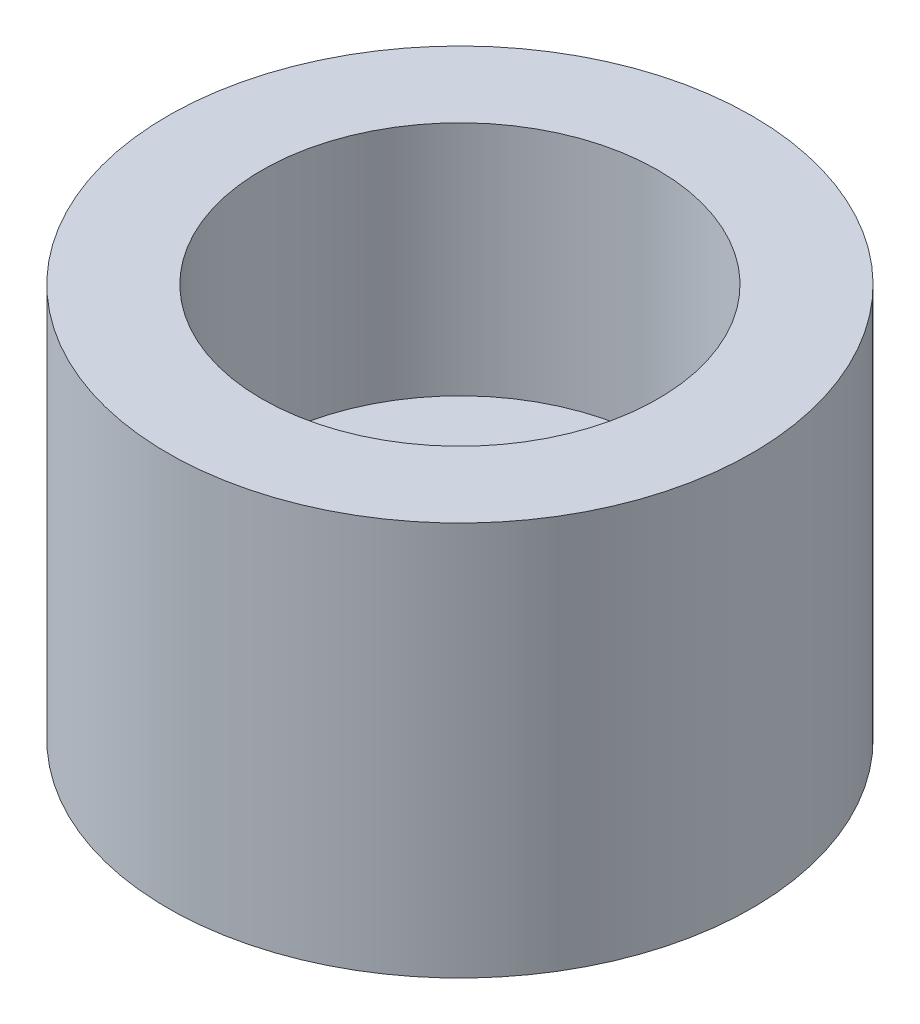
ISO-10303-21;
HEADER;
FILE_DESCRIPTION(('STEP AP214'),'2;1');
FILE_NAME('part.step','',(''),(''),'','','');
FILE_SCHEMA(('AUTOMOTIVE_DESIGN { 1 0 10303 214 1 1 1 1 }'));
ENDSEC;
DATA;
#1=APPLICATION_CONTEXT('core data for automotive mechanical design processes');
#2=APPLICATION_PROTOCOL_DEFINITION('international standard','automotive_design',2000,#1);
#3=PRODUCT_CONTEXT('',#1,'mechanical');
#4=PRODUCT('Part','Part','',(#3));
#5=PRODUCT_RELATED_PRODUCT_CATEGORY('part','',(#4));
#6=PRODUCT_DEFINITION_FORMATION('','',#4);
#7=PRODUCT_DEFINITION_CONTEXT('part definition',#1,'design');
#8=PRODUCT_DEFINITION('design','',#6,#7);
#9=PRODUCT_DEFINITION_SHAPE('','',#8);
#10=(LENGTH_UNIT() NAMED_UNIT(*) SI_UNIT(.MILLI.,.METRE.));
#11=(NAMED_UNIT(*) PLANE_ANGLE_UNIT() SI_UNIT($,.RADIAN.));
#12=(NAMED_UNIT(*) SI_UNIT($,.STERADIAN.) SOLID_ANGLE_UNIT());
#13=UNCERTAINTY_MEASURE_WITH_UNIT(LENGTH_MEASURE(1.E-05),#10,'distance_accuracy_value','');
#14=(GEOMETRIC_REPRESENTATION_CONTEXT(3) GLOBAL_UNCERTAINTY_ASSIGNED_CONTEXT((#13)) GLOBAL_UNIT_ASSIGNED_CONTEXT((#10,
#11,#12)) REPRESENTATION_CONTEXT('',''));
#15=CARTESIAN_POINT('',(0.,0.,0.));
#16=DIRECTION('',(0.,0.,1.));
#17=DIRECTION('',(1.,0.,0.));
#18=AXIS2_PLACEMENT_3D('',#15,#16,#17);
#19=CARTESIAN_POINT('',(0.,4.7625,0.));
#20=DIRECTION('',(0.,-1.,0.));
#21=DIRECTION('',(0.,0.,-1.));
#22=AXIS2_PLACEMENT_3D('',#19,#20,#21);
#23=PLANE('',#22);
#24=CARTESIAN_POINT('',(0.,4.7625,0.));
#25=DIRECTION('',(0.,-1.,0.));
#26=DIRECTION('',(0.,0.,-1.));
#27=AXIS2_PLACEMENT_3D('',#24,#25,#26);
#28=CIRCLE('',#27,7.0612);
#29=CARTESIAN_POINT('',(0.,4.7625,-7.0612));
#30=VERTEX_POINT('',#29);
#31=EDGE_CURVE('E52',#30,#30,#28,.T.);
#32=ORIENTED_EDGE('',*,*,#31,.F.);
#33=EDGE_LOOP('',(#32));
#34=FACE_BOUND('',#33,.T.);
#35=CARTESIAN_POINT('',(0.,4.7625,0.));
#36=DIRECTION('',(0.,-1.,0.));
#37=DIRECTION('',(0.,0.,-1.));
#38=AXIS2_PLACEMENT_3D('',#35,#36,#37);
#39=CIRCLE('',#38,4.7879);
#40=CARTESIAN_POINT('',(0.,4.7625,-4.7879));
#41=VERTEX_POINT('',#40);
#42=EDGE_CURVE('E10',#41,#41,#39,.T.);
#43=ORIENTED_EDGE('',*,*,#42,.T.);
#44=EDGE_LOOP('',(#43));
#45=FACE_BOUND('',#44,.T.);
#46=ADVANCED_FACE('F30',(#34,#45),#23,.F.);
#47=CARTESIAN_POINT('',(0.,0.,0.));
#48=DIRECTION('',(0.,-1.,0.));
#49=DIRECTION('',(0.,0.,-1.));
#50=AXIS2_PLACEMENT_3D('',#47,#48,#49);
#51=CYLINDRICAL_SURFACE('',#50,4.7879);
#52=CARTESIAN_POINT('',(0.,-0.952499999999999,0.));
#53=DIRECTION('',(0.,-1.,0.));
#54=DIRECTION('',(0.,0.,-1.));
#55=AXIS2_PLACEMENT_3D('',#52,#53,#54);
#56=CIRCLE('',#55,4.7879);
#57=CARTESIAN_POINT('',(0.,-0.952499999999999,-4.7879));
#58=VERTEX_POINT('',#57);
#59=EDGE_CURVE('E36',#58,#58,#56,.T.);
#60=ORIENTED_EDGE('',*,*,#59,.T.);
#61=EDGE_LOOP('',(#60));
#62=FACE_BOUND('',#61,.T.);
#63=ORIENTED_EDGE('',*,*,#42,.F.);
#64=EDGE_LOOP('',(#63));
#65=FACE_BOUND('',#64,.T.);
#66=ADVANCED_FACE('F60',(#62,#65),#51,.F.);
#67=CARTESIAN_POINT('',(0.,-0.952499999999999,0.));
#68=DIRECTION('',(0.,-1.,0.));
#69=DIRECTION('',(0.,0.,-1.));
#70=AXIS2_PLACEMENT_3D('',#67,#68,#69);
#71=PLANE('',#70);
#72=ORIENTED_EDGE('',*,*,#59,.F.);
#73=EDGE_LOOP('',(#72));
#74=FACE_BOUND('',#73,.T.);
#75=CARTESIAN_POINT('',(0.,-0.952499999999999,0.));
#76=DIRECTION('',(0.,-1.,0.));
#77=DIRECTION('',(0.,0.,-1.));
#78=AXIS2_PLACEMENT_3D('',#75,#76,#77);
#79=CIRCLE('',#78,2.38125);
#80=CARTESIAN_POINT('',(0.,-0.952499999999999,-2.38125));
#81=VERTEX_POINT('',#80);
#82=EDGE_CURVE('E40',#81,#81,#79,.T.);
#83=ORIENTED_EDGE('',*,*,#82,.T.);
#84=EDGE_LOOP('',(#83));
#85=FACE_BOUND('',#84,.T.);
#86=ADVANCED_FACE('F64',(#74,#85),#71,.F.);
#87=CARTESIAN_POINT('',(0.,0.,0.));
#88=DIRECTION('',(0.,-1.,0.));
#89=DIRECTION('',(0.,0.,-1.));
#90=AXIS2_PLACEMENT_3D('',#87,#88,#89);
#91=CYLINDRICAL_SURFACE('',#90,2.38125);
#92=ORIENTED_EDGE('',*,*,#82,.F.);
#93=EDGE_LOOP('',(#92));
#94=FACE_BOUND('',#93,.T.);
#95=CARTESIAN_POINT('',(0.,-4.7625,0.));
#96=DIRECTION('',(0.,-1.,0.));
#97=DIRECTION('',(0.,0.,-1.));
#98=AXIS2_PLACEMENT_3D('',#95,#96,#97);
#99=CIRCLE('',#98,2.38125);
#100=CARTESIAN_POINT('',(0.,-4.7625,-2.38125));
#101=VERTEX_POINT('',#100);
#102=EDGE_CURVE('E44',#101,#101,#99,.T.);
#103=ORIENTED_EDGE('',*,*,#102,.T.);
#104=EDGE_LOOP('',(#103));
#105=FACE_BOUND('',#104,.T.);
#106=ADVANCED_FACE('F68',(#94,#105),#91,.F.);
#107=CARTESIAN_POINT('',(0.,-4.7625,0.));
#108=DIRECTION('',(0.,-1.,0.));
#109=DIRECTION('',(0.,0.,-1.));
#110=AXIS2_PLACEMENT_3D('',#107,#108,#109);
#111=PLANE('',#110);
#112=CARTESIAN_POINT('',(0.,-4.7625,0.));
#113=DIRECTION('',(0.,-1.,0.));
#114=DIRECTION('',(0.,0.,-1.));
#115=AXIS2_PLACEMENT_3D('',#112,#113,#114);
#116=CIRCLE('',#115,7.0612);
#117=CARTESIAN_POINT('',(0.,-4.7625,-7.0612));
#118=VERTEX_POINT('',#117);
#119=EDGE_CURVE('E49',#118,#118,#116,.T.);
#120=ORIENTED_EDGE('',*,*,#119,.T.);
#121=EDGE_LOOP('',(#120));
#122=FACE_BOUND('',#121,.T.);
#123=ORIENTED_EDGE('',*,*,#102,.F.);
#124=EDGE_LOOP('',(#123));
#125=FACE_BOUND('',#124,.T.);
#126=ADVANCED_FACE('F75',(#122,#125),#111,.T.);
#127=CARTESIAN_POINT('',(0.,0.,0.));
#128=DIRECTION('',(0.,-1.,0.));
#129=DIRECTION('',(0.,0.,-1.));
#130=AXIS2_PLACEMENT_3D('',#127,#128,#129);
#131=CYLINDRICAL_SURFACE('',#130,7.0612);
#132=ORIENTED_EDGE('',*,*,#31,.T.);
#133=EDGE_LOOP('',(#132));
#134=FACE_BOUND('',#133,.T.);
#135=ORIENTED_EDGE('',*,*,#119,.F.);
#136=EDGE_LOOP('',(#135));
#137=FACE_BOUND('',#136,.T.);
#138=ADVANCED_FACE('F56',(#134,#137),#131,.T.);
#139=CLOSED_SHELL('',(#46,#66,#86,#106,#126,#138));
#140=MANIFOLD_SOLID_BREP('B2',#139);
#141=ADVANCED_BREP_SHAPE_REPRESENTATION('',(#18,#140),#14);
#142=SHAPE_DEFINITION_REPRESENTATION(#9,#141);
ENDSEC;
END-ISO-10303-21;
